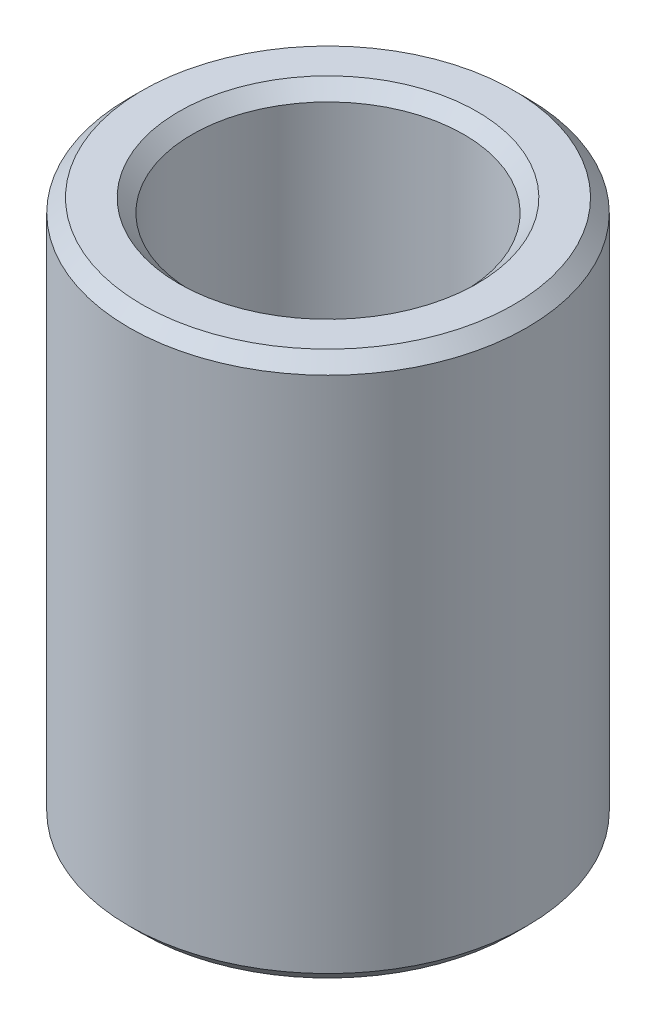
ISO-10303-21;
HEADER;
FILE_DESCRIPTION(('STEP AP214'),'2;1');
FILE_NAME('part.step','',(''),(''),'','','');
FILE_SCHEMA(('AUTOMOTIVE_DESIGN { 1 0 10303 214 1 1 1 1 }'));
ENDSEC;
DATA;
#1=APPLICATION_CONTEXT('core data for automotive mechanical design processes');
#2=APPLICATION_PROTOCOL_DEFINITION('international standard','automotive_design',2000,#1);
#3=PRODUCT_CONTEXT('',#1,'mechanical');
#4=PRODUCT('Part','Part','',(#3));
#5=PRODUCT_RELATED_PRODUCT_CATEGORY('part','',(#4));
#6=PRODUCT_DEFINITION_FORMATION('','',#4);
#7=PRODUCT_DEFINITION_CONTEXT('part definition',#1,'design');
#8=PRODUCT_DEFINITION('design','',#6,#7);
#9=PRODUCT_DEFINITION_SHAPE('','',#8);
#10=(LENGTH_UNIT() NAMED_UNIT(*) SI_UNIT(.MILLI.,.METRE.));
#11=(NAMED_UNIT(*) PLANE_ANGLE_UNIT() SI_UNIT($,.RADIAN.));
#12=(NAMED_UNIT(*) SI_UNIT($,.STERADIAN.) SOLID_ANGLE_UNIT());
#13=UNCERTAINTY_MEASURE_WITH_UNIT(LENGTH_MEASURE(1.E-05),#10,'distance_accuracy_value','');
#14=(GEOMETRIC_REPRESENTATION_CONTEXT(3) GLOBAL_UNCERTAINTY_ASSIGNED_CONTEXT((#13)) GLOBAL_UNIT_ASSIGNED_CONTEXT((#10,
#11,#12)) REPRESENTATION_CONTEXT('',''));
#15=CARTESIAN_POINT('',(0.,0.,0.));
#16=DIRECTION('',(0.,0.,1.));
#17=DIRECTION('',(1.,0.,0.));
#18=AXIS2_PLACEMENT_3D('',#15,#16,#17);
#19=CARTESIAN_POINT('',(0.,157.454296837184,0.));
#20=DIRECTION('',(0.,-1.,0.));
#21=DIRECTION('',(0.,0.,-1.));
#22=AXIS2_PLACEMENT_3D('',#19,#20,#21);
#23=CYLINDRICAL_SURFACE('',#22,57.5);
#24=CARTESIAN_POINT('',(0.,3.82841319461372,0.));
#25=DIRECTION('',(0.,1.,0.));
#26=DIRECTION('',(0.,0.,1.));
#27=AXIS2_PLACEMENT_3D('',#24,#25,#26);
#28=CIRCLE('',#27,57.5);
#29=CARTESIAN_POINT('',(0.,3.82841319461372,57.5));
#30=VERTEX_POINT('',#29);
#31=EDGE_CURVE('E10',#30,#30,#28,.T.);
#32=ORIENTED_EDGE('',*,*,#31,.T.);
#33=EDGE_LOOP('',(#32));
#34=FACE_BOUND('',#33,.T.);
#35=CARTESIAN_POINT('',(0.,153.62588364257,0.));
#36=DIRECTION('',(0.,1.,0.));
#37=DIRECTION('',(0.,0.,1.));
#38=AXIS2_PLACEMENT_3D('',#35,#36,#37);
#39=CIRCLE('',#38,57.5);
#40=CARTESIAN_POINT('',(0.,153.62588364257,57.5));
#41=VERTEX_POINT('',#40);
#42=EDGE_CURVE('E50',#41,#41,#39,.F.);
#43=ORIENTED_EDGE('',*,*,#42,.T.);
#44=EDGE_LOOP('',(#43));
#45=FACE_BOUND('',#44,.T.);
#46=ADVANCED_FACE('F39',(#34,#45),#23,.T.);
#47=CARTESIAN_POINT('',(0.,157.454296837184,0.));
#48=DIRECTION('',(0.,1.,0.));
#49=DIRECTION('',(0.,0.,1.));
#50=AXIS2_PLACEMENT_3D('',#47,#48,#49);
#51=PLANE('',#50);
#52=CARTESIAN_POINT('',(0.,157.454296837184,0.));
#53=DIRECTION('',(0.,1.,0.));
#54=DIRECTION('',(0.,0.,1.));
#55=AXIS2_PLACEMENT_3D('',#52,#53,#54);
#56=CIRCLE('',#55,43.1091704103571);
#57=CARTESIAN_POINT('',(0.,157.454296837184,43.1091704103571));
#58=VERTEX_POINT('',#57);
#59=EDGE_CURVE('E58',#58,#58,#56,.F.);
#60=ORIENTED_EDGE('',*,*,#59,.T.);
#61=EDGE_LOOP('',(#60));
#62=FACE_BOUND('',#61,.T.);
#63=CARTESIAN_POINT('',(0.,157.454296837184,0.));
#64=DIRECTION('',(0.,1.,0.));
#65=DIRECTION('',(0.,0.,1.));
#66=AXIS2_PLACEMENT_3D('',#63,#64,#65);
#67=CIRCLE('',#66,53.6715868053862);
#68=CARTESIAN_POINT('',(0.,157.454296837184,53.6715868053862));
#69=VERTEX_POINT('',#68);
#70=EDGE_CURVE('E61',#69,#69,#67,.T.);
#71=ORIENTED_EDGE('',*,*,#70,.T.);
#72=EDGE_LOOP('',(#71));
#73=FACE_BOUND('',#72,.T.);
#74=ADVANCED_FACE('F88',(#62,#73),#51,.T.);
#75=CARTESIAN_POINT('',(0.,0.,0.));
#76=DIRECTION('',(0.,1.,0.));
#77=DIRECTION('',(0.,0.,1.));
#78=AXIS2_PLACEMENT_3D('',#75,#76,#77);
#79=PLANE('',#78);
#80=CARTESIAN_POINT('',(0.,0.,0.));
#81=DIRECTION('',(0.,1.,0.));
#82=DIRECTION('',(0.,0.,1.));
#83=AXIS2_PLACEMENT_3D('',#80,#81,#82);
#84=CIRCLE('',#83,43.1091704103571);
#85=CARTESIAN_POINT('',(0.,0.,43.1091704103571));
#86=VERTEX_POINT('',#85);
#87=EDGE_CURVE('E51',#86,#86,#84,.T.);
#88=ORIENTED_EDGE('',*,*,#87,.T.);
#89=EDGE_LOOP('',(#88));
#90=FACE_BOUND('',#89,.T.);
#91=CARTESIAN_POINT('',(0.,0.,0.));
#92=DIRECTION('',(0.,1.,0.));
#93=DIRECTION('',(0.,0.,1.));
#94=AXIS2_PLACEMENT_3D('',#91,#92,#93);
#95=CIRCLE('',#94,53.6715868053863);
#96=CARTESIAN_POINT('',(0.,0.,53.6715868053863));
#97=VERTEX_POINT('',#96);
#98=EDGE_CURVE('E54',#97,#97,#95,.F.);
#99=ORIENTED_EDGE('',*,*,#98,.T.);
#100=EDGE_LOOP('',(#99));
#101=FACE_BOUND('',#100,.T.);
#102=ADVANCED_FACE('F83',(#90,#101),#79,.F.);
#103=CARTESIAN_POINT('',(0.,157.454296837184,0.));
#104=DIRECTION('',(0.,-1.,0.));
#105=DIRECTION('',(0.,0.,-1.));
#106=AXIS2_PLACEMENT_3D('',#103,#104,#105);
#107=CYLINDRICAL_SURFACE('',#106,39.2807572157434);
#108=CARTESIAN_POINT('',(0.,153.62588364257,0.));
#109=DIRECTION('',(0.,1.,0.));
#110=DIRECTION('',(0.,0.,1.));
#111=AXIS2_PLACEMENT_3D('',#108,#109,#110);
#112=CIRCLE('',#111,39.2807572157434);
#113=CARTESIAN_POINT('',(0.,153.62588364257,39.2807572157434));
#114=VERTEX_POINT('',#113);
#115=EDGE_CURVE('E67',#114,#114,#112,.T.);
#116=ORIENTED_EDGE('',*,*,#115,.T.);
#117=EDGE_LOOP('',(#116));
#118=FACE_BOUND('',#117,.T.);
#119=CARTESIAN_POINT('',(0.,3.82841319461377,0.));
#120=DIRECTION('',(0.,1.,0.));
#121=DIRECTION('',(0.,0.,1.));
#122=AXIS2_PLACEMENT_3D('',#119,#120,#121);
#123=CIRCLE('',#122,39.2807572157434);
#124=CARTESIAN_POINT('',(0.,3.82841319461377,39.2807572157434));
#125=VERTEX_POINT('',#124);
#126=EDGE_CURVE('E69',#125,#125,#123,.F.);
#127=ORIENTED_EDGE('',*,*,#126,.T.);
#128=EDGE_LOOP('',(#127));
#129=FACE_BOUND('',#128,.T.);
#130=ADVANCED_FACE('F71',(#118,#129),#107,.F.);
#131=CARTESIAN_POINT('',(0.,153.62588364257,0.));
#132=DIRECTION('',(0.,1.,0.));
#133=DIRECTION('',(0.,0.,1.));
#134=AXIS2_PLACEMENT_3D('',#131,#132,#133);
#135=CONICAL_SURFACE('',#134,39.2807572157434,0.785398163397448);
#136=ORIENTED_EDGE('',*,*,#59,.F.);
#137=EDGE_LOOP('',(#136));
#138=FACE_BOUND('',#137,.T.);
#139=ORIENTED_EDGE('',*,*,#115,.F.);
#140=EDGE_LOOP('',(#139));
#141=FACE_BOUND('',#140,.T.);
#142=ADVANCED_FACE('F77',(#138,#141),#135,.F.);
#143=CARTESIAN_POINT('',(0.,0.,0.));
#144=DIRECTION('',(0.,-1.,0.));
#145=DIRECTION('',(0.,0.,-1.));
#146=AXIS2_PLACEMENT_3D('',#143,#144,#145);
#147=CONICAL_SURFACE('',#146,43.1091704103571,0.785398163397445);
#148=ORIENTED_EDGE('',*,*,#126,.F.);
#149=EDGE_LOOP('',(#148));
#150=FACE_BOUND('',#149,.T.);
#151=ORIENTED_EDGE('',*,*,#87,.F.);
#152=EDGE_LOOP('',(#151));
#153=FACE_BOUND('',#152,.T.);
#154=ADVANCED_FACE('F73',(#150,#153),#147,.F.);
#155=CARTESIAN_POINT('',(0.,3.82841319461372,0.));
#156=DIRECTION('',(0.,1.,0.));
#157=DIRECTION('',(0.,0.,1.));
#158=AXIS2_PLACEMENT_3D('',#155,#156,#157);
#159=CONICAL_SURFACE('',#158,57.5,0.785398163397452);
#160=CARTESIAN_POINT('',(0.,0.,53.6715868053863));
#161=CARTESIAN_POINT('',(0.,0.0398793041105574,53.7114661094968));
#162=CARTESIAN_POINT('',(0.,0.0797586082211175,53.7513454136074));
#163=CARTESIAN_POINT('',(0.,0.159517216442238,53.8311040218285));
#164=CARTESIAN_POINT('',(0.,0.199396520552798,53.8709833259391));
#165=CARTESIAN_POINT('',(0.,0.279155128773917,53.9507419341602));
#166=CARTESIAN_POINT('',(0.,0.319034432884476,53.9906212382707));
#167=CARTESIAN_POINT('',(0.,0.398793041105595,54.0703798464919));
#168=CARTESIAN_POINT('',(0.,0.438672345216155,54.1102591506024));
#169=CARTESIAN_POINT('',(0.,0.518430953437274,54.1900177588235));
#170=CARTESIAN_POINT('',(0.,0.558310257547833,54.2298970629341));
#171=CARTESIAN_POINT('',(0.,0.638068865768952,54.3096556711552));
#172=CARTESIAN_POINT('',(0.,0.677948169879512,54.3495349752658));
#173=CARTESIAN_POINT('',(0.,0.757706778100632,54.4292935834869));
#174=CARTESIAN_POINT('',(0.,0.797586082211191,54.4691728875975));
#175=CARTESIAN_POINT('',(0.,0.877344690432309,54.5489314958186));
#176=CARTESIAN_POINT('',(0.,0.917223994542869,54.5888107999291));
#177=CARTESIAN_POINT('',(0.,0.996982602763988,54.6685694081503));
#178=CARTESIAN_POINT('',(0.,1.03686190687455,54.7084487122608));
#179=CARTESIAN_POINT('',(0.,1.11662051509567,54.7882073204819));
#180=CARTESIAN_POINT('',(0.,1.15649981920623,54.8280866245925));
#181=CARTESIAN_POINT('',(0.,1.23625842742735,54.9078452328136));
#182=CARTESIAN_POINT('',(0.,1.27613773153791,54.9477245369242));
#183=CARTESIAN_POINT('',(0.,1.35589633975902,55.0274831451453));
#184=CARTESIAN_POINT('',(0.,1.39577564386958,55.0673624492558));
#185=CARTESIAN_POINT('',(0.,1.4755342520907,55.147121057477));
#186=CARTESIAN_POINT('',(0.,1.51541355620126,55.1870003615875));
#187=CARTESIAN_POINT('',(0.,1.59517216442238,55.2667589698086));
#188=CARTESIAN_POINT('',(0.,1.63505146853294,55.3066382739192));
#189=CARTESIAN_POINT('',(0.,1.71481007675406,55.3863968821403));
#190=CARTESIAN_POINT('',(0.,1.75468938086462,55.4262761862509));
#191=CARTESIAN_POINT('',(0.,1.83444798908574,55.506034794472));
#192=CARTESIAN_POINT('',(0.,1.8743272931963,55.5459140985826));
#193=CARTESIAN_POINT('',(0.,1.95408590141742,55.6256727068037));
#194=CARTESIAN_POINT('',(0.,1.99396520552798,55.6655520109142));
#195=CARTESIAN_POINT('',(0.,2.0737238137491,55.7453106191354));
#196=CARTESIAN_POINT('',(0.,2.11360311785966,55.7851899232459));
#197=CARTESIAN_POINT('',(0.,2.19336172608078,55.864948531467));
#198=CARTESIAN_POINT('',(0.,2.23324103019134,55.9048278355776));
#199=CARTESIAN_POINT('',(0.,2.31299963841245,55.9845864437987));
#200=CARTESIAN_POINT('',(0.,2.35287894252301,56.0244657479093));
#201=CARTESIAN_POINT('',(0.,2.43263755074413,56.1042243561304));
#202=CARTESIAN_POINT('',(0.,2.47251685485469,56.144103660241));
#203=CARTESIAN_POINT('',(0.,2.55227546307581,56.2238622684621));
#204=CARTESIAN_POINT('',(0.,2.59215476718637,56.2637415725726));
#205=CARTESIAN_POINT('',(0.,2.67191337540749,56.3435001807938));
#206=CARTESIAN_POINT('',(0.,2.71179267951805,56.3833794849043));
#207=CARTESIAN_POINT('',(0.,2.79155128773917,56.4631380931255));
#208=CARTESIAN_POINT('',(0.,2.83143059184973,56.503017397236));
#209=CARTESIAN_POINT('',(0.,2.91118920007085,56.5827760054571));
#210=CARTESIAN_POINT('',(0.,2.95106850418141,56.6226553095677));
#211=CARTESIAN_POINT('',(0.,3.03082711240253,56.7024139177888));
#212=CARTESIAN_POINT('',(0.,3.07070641651309,56.7422932218994));
#213=CARTESIAN_POINT('',(0.,3.1504650247342,56.8220518301205));
#214=CARTESIAN_POINT('',(0.,3.19034432884476,56.861931134231));
#215=CARTESIAN_POINT('',(0.,3.27010293706588,56.9416897424522));
#216=CARTESIAN_POINT('',(0.,3.30998224117644,56.9815690465627));
#217=CARTESIAN_POINT('',(0.,3.38974084939756,57.0613276547838));
#218=CARTESIAN_POINT('',(0.,3.42962015350812,57.1012069588944));
#219=CARTESIAN_POINT('',(0.,3.50937876172924,57.1809655671155));
#220=CARTESIAN_POINT('',(0.,3.5492580658398,57.2208448712261));
#221=CARTESIAN_POINT('',(0.,3.62901667406092,57.3006034794472));
#222=CARTESIAN_POINT('',(0.,3.66889597817148,57.3404827835578));
#223=CARTESIAN_POINT('',(0.,3.7486545863926,57.4202413917789));
#224=CARTESIAN_POINT('',(0.,3.78853389050316,57.4601206958894));
#225=CARTESIAN_POINT('',(0.,3.82841319461372,57.5));
#226=B_SPLINE_CURVE_WITH_KNOTS('',3,(#160,#161,#162,#163,#164,#165,#166,#167,#168,#169,#170,
#171,#172,#173,#174,#175,#176,#177,#178,#179,#180,#181,#182,#183,#184,#185,#186,#187,#188,#189,
#190,#191,#192,#193,#194,#195,#196,#197,#198,#199,#200,#201,#202,#203,#204,#205,#206,#207,#208,
#209,#210,#211,#212,#213,#214,#215,#216,#217,#218,#219,#220,#221,#222,#223,#224,#225),
.UNSPECIFIED.,.F.,.F.,(4,2,2,2,2,2,2,2,2,2,2,2,2,2,2,2,2,2,2,2,2,2,2,2,2,2,2,2,2,2,2,2,4),(0.,
0.169193558193465,0.338387116386925,0.507580674580391,0.676774232773856,0.845967790967321,
1.01516134916078,1.18435490735425,1.35354846554771,1.52274202374118,1.69193558193464,
1.8611291401281,2.03032269832157,2.19951625651503,2.36870981470849,2.53790337290196,
2.70709693109542,2.87629048928889,3.04548404748235,3.21467760567581,3.38387116386928,
3.55306472206274,3.7222582802562,3.89145183844967,4.06064539664314,4.2298389548366,
4.39903251303006,4.56822607122352,4.73741962941699,4.90661318761046,5.07580674580392,
5.24500030399738,5.41419386219085),.UNSPECIFIED.);
#227=EDGE_CURVE('BSEAM76',#97,#30,#226,.T.);
#228=ORIENTED_EDGE('',*,*,#98,.F.);
#229=ORIENTED_EDGE('',*,*,#31,.F.);
#230=ORIENTED_EDGE('',*,*,#227,.T.);
#231=ORIENTED_EDGE('',*,*,#227,.F.);
#232=EDGE_LOOP('',(#228,#230,#229,#231));
#233=FACE_BOUND('',#232,.T.);
#234=ADVANCED_FACE('F76',(#233),#159,.T.);
#235=CARTESIAN_POINT('',(0.,157.454296837184,0.));
#236=DIRECTION('',(0.,-1.,0.));
#237=DIRECTION('',(0.,0.,-1.));
#238=AXIS2_PLACEMENT_3D('',#235,#236,#237);
#239=CONICAL_SURFACE('',#238,53.6715868053862,0.785398163397449);
#240=ORIENTED_EDGE('',*,*,#42,.F.);
#241=EDGE_LOOP('',(#240));
#242=FACE_BOUND('',#241,.T.);
#243=ORIENTED_EDGE('',*,*,#70,.F.);
#244=EDGE_LOOP('',(#243));
#245=FACE_BOUND('',#244,.T.);
#246=ADVANCED_FACE('F45',(#242,#245),#239,.T.);
#247=CLOSED_SHELL('',(#46,#74,#102,#130,#142,#154,#234,#246));
#248=MANIFOLD_SOLID_BREP('B2',#247);
#249=ADVANCED_BREP_SHAPE_REPRESENTATION('',(#18,#248),#14);
#250=SHAPE_DEFINITION_REPRESENTATION(#9,#249);
ENDSEC;
END-ISO-10303-21;
